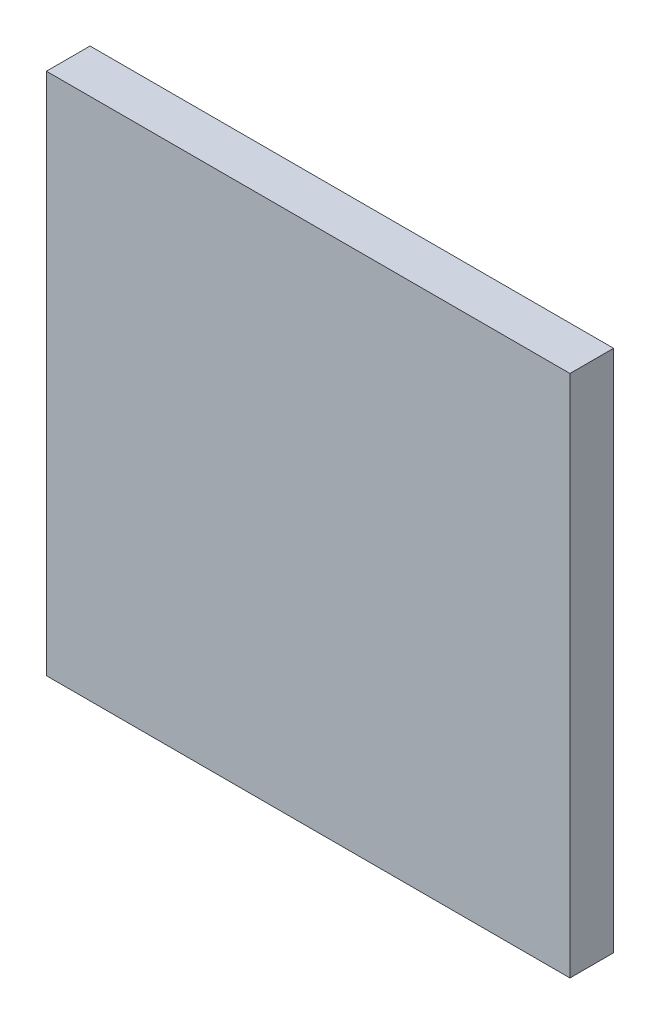
ISO-10303-21;
HEADER;
FILE_DESCRIPTION(('STEP AP214'),'2;1');
FILE_NAME('part.step','',(''),(''),'','','');
FILE_SCHEMA(('AUTOMOTIVE_DESIGN { 1 0 10303 214 1 1 1 1 }'));
ENDSEC;
DATA;
#1=APPLICATION_CONTEXT('core data for automotive mechanical design processes');
#2=APPLICATION_PROTOCOL_DEFINITION('international standard','automotive_design',2000,#1);
#3=PRODUCT_CONTEXT('',#1,'mechanical');
#4=PRODUCT('Part','Part','',(#3));
#5=PRODUCT_RELATED_PRODUCT_CATEGORY('part','',(#4));
#6=PRODUCT_DEFINITION_FORMATION('','',#4);
#7=PRODUCT_DEFINITION_CONTEXT('part definition',#1,'design');
#8=PRODUCT_DEFINITION('design','',#6,#7);
#9=PRODUCT_DEFINITION_SHAPE('','',#8);
#10=(LENGTH_UNIT() NAMED_UNIT(*) SI_UNIT(.MILLI.,.METRE.));
#11=(NAMED_UNIT(*) PLANE_ANGLE_UNIT() SI_UNIT($,.RADIAN.));
#12=(NAMED_UNIT(*) SI_UNIT($,.STERADIAN.) SOLID_ANGLE_UNIT());
#13=UNCERTAINTY_MEASURE_WITH_UNIT(LENGTH_MEASURE(1.E-05),#10,'distance_accuracy_value','');
#14=(GEOMETRIC_REPRESENTATION_CONTEXT(3) GLOBAL_UNCERTAINTY_ASSIGNED_CONTEXT((#13)) GLOBAL_UNIT_ASSIGNED_CONTEXT((#10,
#11,#12)) REPRESENTATION_CONTEXT('',''));
#15=CARTESIAN_POINT('',(0.,0.,0.));
#16=DIRECTION('',(0.,0.,1.));
#17=DIRECTION('',(1.,0.,0.));
#18=AXIS2_PLACEMENT_3D('',#15,#16,#17);
#19=CARTESIAN_POINT('',(152.4,-152.4,25.4));
#20=DIRECTION('',(-1.,0.,0.));
#21=DIRECTION('',(0.,0.,1.));
#22=AXIS2_PLACEMENT_3D('',#19,#20,#21);
#23=PLANE('',#22);
#24=DIRECTION('',(0.,1.,0.));
#25=VECTOR('',#24,1.);
#26=CARTESIAN_POINT('',(152.4,-152.4,0.));
#27=LINE('',#26,#25);
#28=CARTESIAN_POINT('',(152.4,-152.4,0.));
#29=VERTEX_POINT('',#28);
#30=CARTESIAN_POINT('',(152.4,152.4,0.));
#31=VERTEX_POINT('',#30);
#32=EDGE_CURVE('E99',#29,#31,#27,.T.);
#33=ORIENTED_EDGE('',*,*,#32,.T.);
#34=DIRECTION('',(0.,0.,-1.));
#35=VECTOR('',#34,1.);
#36=CARTESIAN_POINT('',(152.4,152.4,25.4));
#37=LINE('',#36,#35);
#38=CARTESIAN_POINT('',(152.4,152.4,25.4));
#39=VERTEX_POINT('',#38);
#40=EDGE_CURVE('E11',#39,#31,#37,.T.);
#41=ORIENTED_EDGE('',*,*,#40,.F.);
#42=DIRECTION('',(0.,1.,0.));
#43=VECTOR('',#42,1.);
#44=CARTESIAN_POINT('',(152.4,-152.4,25.4));
#45=LINE('',#44,#43);
#46=CARTESIAN_POINT('',(152.4,-152.4,25.4));
#47=VERTEX_POINT('',#46);
#48=EDGE_CURVE('E87',#47,#39,#45,.T.);
#49=ORIENTED_EDGE('',*,*,#48,.F.);
#50=DIRECTION('',(0.,0.,-1.));
#51=VECTOR('',#50,1.);
#52=CARTESIAN_POINT('',(152.4,-152.4,25.4));
#53=LINE('',#52,#51);
#54=EDGE_CURVE('E95',#47,#29,#53,.T.);
#55=ORIENTED_EDGE('',*,*,#54,.T.);
#56=EDGE_LOOP('',(#33,#41,#49,#55));
#57=FACE_BOUND('',#56,.T.);
#58=ADVANCED_FACE('F36',(#57),#23,.F.);
#59=CARTESIAN_POINT('',(-152.4,152.4,25.4));
#60=DIRECTION('',(0.,-1.,0.));
#61=DIRECTION('',(0.,0.,-1.));
#62=AXIS2_PLACEMENT_3D('',#59,#60,#61);
#63=PLANE('',#62);
#64=DIRECTION('',(-1.,0.,0.));
#65=VECTOR('',#64,1.);
#66=CARTESIAN_POINT('',(-152.4,152.4,0.));
#67=LINE('',#66,#65);
#68=CARTESIAN_POINT('',(-152.4,152.4,0.));
#69=VERTEX_POINT('',#68);
#70=EDGE_CURVE('E91',#31,#69,#67,.T.);
#71=ORIENTED_EDGE('',*,*,#70,.T.);
#72=DIRECTION('',(0.,0.,-1.));
#73=VECTOR('',#72,1.);
#74=CARTESIAN_POINT('',(-152.4,152.4,25.4));
#75=LINE('',#74,#73);
#76=CARTESIAN_POINT('',(-152.4,152.4,25.4));
#77=VERTEX_POINT('',#76);
#78=EDGE_CURVE('E44',#77,#69,#75,.T.);
#79=ORIENTED_EDGE('',*,*,#78,.F.);
#80=DIRECTION('',(-1.,0.,0.));
#81=VECTOR('',#80,1.);
#82=CARTESIAN_POINT('',(-152.4,152.4,25.4));
#83=LINE('',#82,#81);
#84=EDGE_CURVE('E82',#39,#77,#83,.T.);
#85=ORIENTED_EDGE('',*,*,#84,.F.);
#86=ORIENTED_EDGE('',*,*,#40,.T.);
#87=EDGE_LOOP('',(#71,#79,#85,#86));
#88=FACE_BOUND('',#87,.T.);
#89=ADVANCED_FACE('F90',(#88),#63,.F.);
#90=CARTESIAN_POINT('',(-152.4,-152.4,25.4));
#91=DIRECTION('',(1.,0.,0.));
#92=DIRECTION('',(0.,0.,-1.));
#93=AXIS2_PLACEMENT_3D('',#90,#91,#92);
#94=PLANE('',#93);
#95=DIRECTION('',(0.,-1.,0.));
#96=VECTOR('',#95,1.);
#97=CARTESIAN_POINT('',(-152.4,-152.4,0.));
#98=LINE('',#97,#96);
#99=CARTESIAN_POINT('',(-152.4,-152.4,0.));
#100=VERTEX_POINT('',#99);
#101=EDGE_CURVE('E69',#69,#100,#98,.T.);
#102=ORIENTED_EDGE('',*,*,#101,.T.);
#103=DIRECTION('',(0.,0.,-1.));
#104=VECTOR('',#103,1.);
#105=CARTESIAN_POINT('',(-152.4,-152.4,25.4));
#106=LINE('',#105,#104);
#107=CARTESIAN_POINT('',(-152.4,-152.4,25.4));
#108=VERTEX_POINT('',#107);
#109=EDGE_CURVE('E92',#108,#100,#106,.T.);
#110=ORIENTED_EDGE('',*,*,#109,.F.);
#111=DIRECTION('',(0.,-1.,0.));
#112=VECTOR('',#111,1.);
#113=CARTESIAN_POINT('',(-152.4,-152.4,25.4));
#114=LINE('',#113,#112);
#115=EDGE_CURVE('E85',#77,#108,#114,.T.);
#116=ORIENTED_EDGE('',*,*,#115,.F.);
#117=ORIENTED_EDGE('',*,*,#78,.T.);
#118=EDGE_LOOP('',(#102,#110,#116,#117));
#119=FACE_BOUND('',#118,.T.);
#120=ADVANCED_FACE('F93',(#119),#94,.F.);
#121=CARTESIAN_POINT('',(-152.4,-152.4,25.4));
#122=DIRECTION('',(0.,1.,0.));
#123=DIRECTION('',(0.,0.,1.));
#124=AXIS2_PLACEMENT_3D('',#121,#122,#123);
#125=PLANE('',#124);
#126=DIRECTION('',(1.,0.,0.));
#127=VECTOR('',#126,1.);
#128=CARTESIAN_POINT('',(-152.4,-152.4,0.));
#129=LINE('',#128,#127);
#130=EDGE_CURVE('E75',#100,#29,#129,.T.);
#131=ORIENTED_EDGE('',*,*,#130,.T.);
#132=ORIENTED_EDGE('',*,*,#54,.F.);
#133=DIRECTION('',(1.,0.,0.));
#134=VECTOR('',#133,1.);
#135=CARTESIAN_POINT('',(-152.4,-152.4,25.4));
#136=LINE('',#135,#134);
#137=EDGE_CURVE('E52',#108,#47,#136,.T.);
#138=ORIENTED_EDGE('',*,*,#137,.F.);
#139=ORIENTED_EDGE('',*,*,#109,.T.);
#140=EDGE_LOOP('',(#131,#132,#138,#139));
#141=FACE_BOUND('',#140,.T.);
#142=ADVANCED_FACE('F106',(#141),#125,.F.);
#143=CARTESIAN_POINT('',(0.,0.,25.4));
#144=DIRECTION('',(0.,0.,-1.));
#145=DIRECTION('',(-1.,0.,0.));
#146=AXIS2_PLACEMENT_3D('',#143,#144,#145);
#147=PLANE('',#146);
#148=ORIENTED_EDGE('',*,*,#48,.T.);
#149=ORIENTED_EDGE('',*,*,#84,.T.);
#150=ORIENTED_EDGE('',*,*,#115,.T.);
#151=ORIENTED_EDGE('',*,*,#137,.T.);
#152=EDGE_LOOP('',(#148,#149,#150,#151));
#153=FACE_BOUND('',#152,.T.);
#154=ADVANCED_FACE('F83',(#153),#147,.F.);
#155=CARTESIAN_POINT('',(0.,0.,0.));
#156=DIRECTION('',(0.,0.,-1.));
#157=DIRECTION('',(-1.,0.,0.));
#158=AXIS2_PLACEMENT_3D('',#155,#156,#157);
#159=PLANE('',#158);
#160=ORIENTED_EDGE('',*,*,#32,.F.);
#161=ORIENTED_EDGE('',*,*,#130,.F.);
#162=ORIENTED_EDGE('',*,*,#101,.F.);
#163=ORIENTED_EDGE('',*,*,#70,.F.);
#164=EDGE_LOOP('',(#160,#161,#162,#163));
#165=FACE_BOUND('',#164,.T.);
#166=ADVANCED_FACE('F109',(#165),#159,.T.);
#167=CLOSED_SHELL('',(#58,#89,#120,#142,#154,#166));
#168=MANIFOLD_SOLID_BREP('B2',#167);
#169=ADVANCED_BREP_SHAPE_REPRESENTATION('',(#18,#168),#14);
#170=SHAPE_DEFINITION_REPRESENTATION(#9,#169);
ENDSEC;
END-ISO-10303-21;
